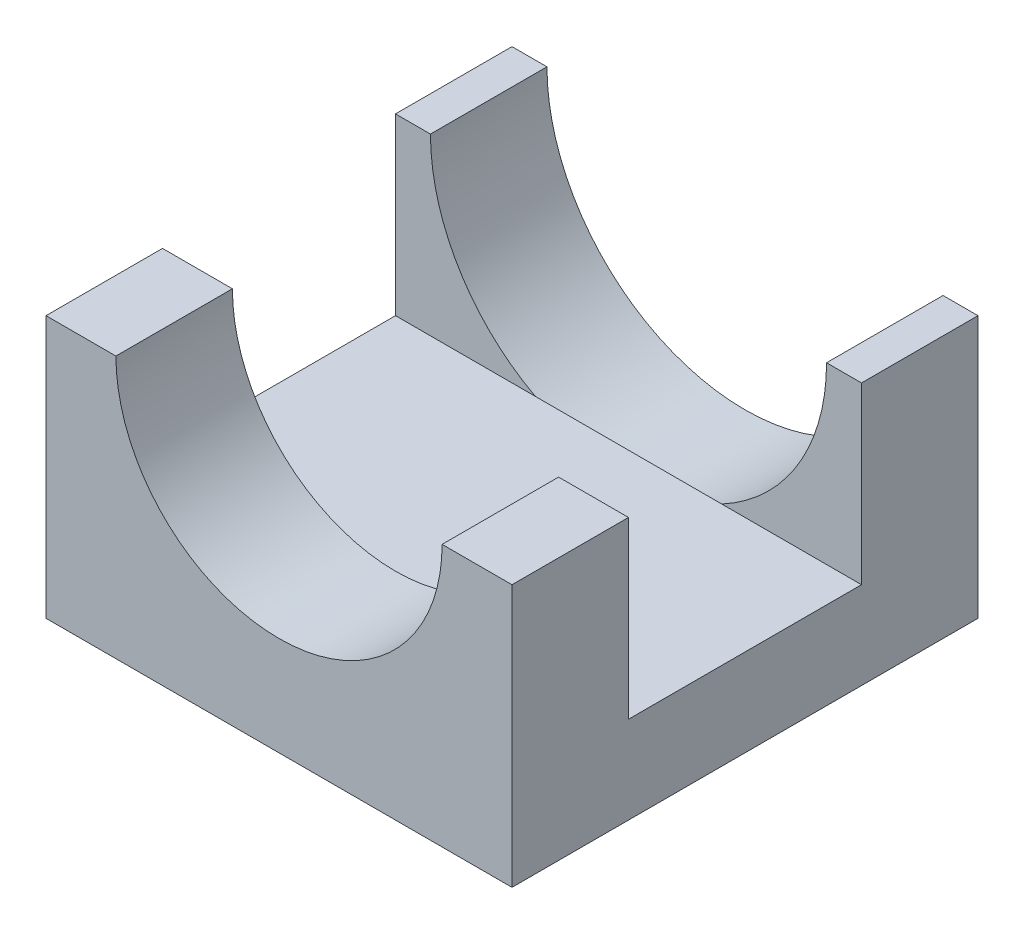
ISO-10303-21;
HEADER;
FILE_DESCRIPTION(('STEP AP214'),'2;1');
FILE_NAME('part.step','',(''),(''),'','','');
FILE_SCHEMA(('AUTOMOTIVE_DESIGN { 1 0 10303 214 1 1 1 1 }'));
ENDSEC;
DATA;
#1=APPLICATION_CONTEXT('core data for automotive mechanical design processes');
#2=APPLICATION_PROTOCOL_DEFINITION('international standard','automotive_design',2000,#1);
#3=PRODUCT_CONTEXT('',#1,'mechanical');
#4=PRODUCT('Part','Part','',(#3));
#5=PRODUCT_RELATED_PRODUCT_CATEGORY('part','',(#4));
#6=PRODUCT_DEFINITION_FORMATION('','',#4);
#7=PRODUCT_DEFINITION_CONTEXT('part definition',#1,'design');
#8=PRODUCT_DEFINITION('design','',#6,#7);
#9=PRODUCT_DEFINITION_SHAPE('','',#8);
#10=(LENGTH_UNIT() NAMED_UNIT(*) SI_UNIT(.MILLI.,.METRE.));
#11=(NAMED_UNIT(*) PLANE_ANGLE_UNIT() SI_UNIT($,.RADIAN.));
#12=(NAMED_UNIT(*) SI_UNIT($,.STERADIAN.) SOLID_ANGLE_UNIT());
#13=UNCERTAINTY_MEASURE_WITH_UNIT(LENGTH_MEASURE(1.E-05),#10,'distance_accuracy_value','');
#14=(GEOMETRIC_REPRESENTATION_CONTEXT(3) GLOBAL_UNCERTAINTY_ASSIGNED_CONTEXT((#13)) GLOBAL_UNIT_ASSIGNED_CONTEXT((#10,
#11,#12)) REPRESENTATION_CONTEXT('',''));
#15=CARTESIAN_POINT('',(0.,0.,0.));
#16=DIRECTION('',(0.,0.,1.));
#17=DIRECTION('',(1.,0.,0.));
#18=AXIS2_PLACEMENT_3D('',#15,#16,#17);
#19=CARTESIAN_POINT('',(0.,0.,10.));
#20=DIRECTION('',(0.,0.,-1.));
#21=DIRECTION('',(-1.,0.,0.));
#22=AXIS2_PLACEMENT_3D('',#19,#20,#21);
#23=PLANE('',#22);
#24=CARTESIAN_POINT('',(0.,0.,10.));
#25=DIRECTION('',(0.,0.,-1.));
#26=DIRECTION('',(-1.,0.,0.));
#27=AXIS2_PLACEMENT_3D('',#24,#25,#26);
#28=CIRCLE('',#27,17.);
#29=CARTESIAN_POINT('',(8.,-15.,10.));
#30=VERTEX_POINT('',#29);
#31=CARTESIAN_POINT('',(-8.00000000000001,-15.,10.));
#32=VERTEX_POINT('',#31);
#33=EDGE_CURVE('E119',#30,#32,#28,.T.);
#34=ORIENTED_EDGE('',*,*,#33,.T.);
#35=DIRECTION('',(-1.,0.,0.));
#36=VECTOR('',#35,1.);
#37=CARTESIAN_POINT('',(-20.,-15.,10.));
#38=LINE('',#37,#36);
#39=EDGE_CURVE('E249',#30,#32,#38,.T.);
#40=ORIENTED_EDGE('',*,*,#39,.F.);
#41=EDGE_LOOP('',(#34,#40));
#42=FACE_BOUND('',#41,.T.);
#43=ADVANCED_FACE('F47',(#42),#23,.T.);
#44=CARTESIAN_POINT('',(-20.,0.,0.));
#45=DIRECTION('',(0.,-1.,0.));
#46=DIRECTION('',(1.,0.,0.));
#47=AXIS2_PLACEMENT_3D('',#44,#45,#46);
#48=PLANE('',#47);
#49=DIRECTION('',(0.,0.,1.));
#50=VECTOR('',#49,1.);
#51=CARTESIAN_POINT('',(-20.,0.,0.));
#52=LINE('',#51,#50);
#53=CARTESIAN_POINT('',(-20.,0.,0.));
#54=VERTEX_POINT('',#53);
#55=CARTESIAN_POINT('',(-20.,0.,10.));
#56=VERTEX_POINT('',#55);
#57=EDGE_CURVE('E196',#54,#56,#52,.T.);
#58=ORIENTED_EDGE('',*,*,#57,.T.);
#59=DIRECTION('',(1.,0.,0.));
#60=VECTOR('',#59,1.);
#61=CARTESIAN_POINT('',(-20.,0.,10.));
#62=LINE('',#61,#60);
#63=CARTESIAN_POINT('',(-17.,0.,10.));
#64=VERTEX_POINT('',#63);
#65=EDGE_CURVE('E11',#56,#64,#62,.T.);
#66=ORIENTED_EDGE('',*,*,#65,.T.);
#67=DIRECTION('',(0.,0.,-1.));
#68=VECTOR('',#67,1.);
#69=CARTESIAN_POINT('',(-17.,0.,10.));
#70=LINE('',#69,#68);
#71=CARTESIAN_POINT('',(-17.,0.,0.));
#72=VERTEX_POINT('',#71);
#73=EDGE_CURVE('E161',#72,#64,#70,.F.);
#74=ORIENTED_EDGE('',*,*,#73,.F.);
#75=DIRECTION('',(1.,0.,0.));
#76=VECTOR('',#75,1.);
#77=CARTESIAN_POINT('',(-20.,0.,0.));
#78=LINE('',#77,#76);
#79=EDGE_CURVE('E200',#54,#72,#78,.T.);
#80=ORIENTED_EDGE('',*,*,#79,.F.);
#81=EDGE_LOOP('',(#58,#66,#74,#80));
#82=FACE_BOUND('',#81,.T.);
#83=ADVANCED_FACE('F315',(#82),#48,.F.);
#84=DIRECTION('',(0.,0.,-1.));
#85=VECTOR('',#84,1.);
#86=CARTESIAN_POINT('',(17.,0.,10.));
#87=LINE('',#86,#85);
#88=CARTESIAN_POINT('',(17.,0.,10.));
#89=VERTEX_POINT('',#88);
#90=CARTESIAN_POINT('',(17.,0.,0.));
#91=VERTEX_POINT('',#90);
#92=EDGE_CURVE('E155',#89,#91,#87,.T.);
#93=ORIENTED_EDGE('',*,*,#92,.F.);
#94=DIRECTION('',(-1.,0.,0.));
#95=VECTOR('',#94,1.);
#96=CARTESIAN_POINT('',(-20.,0.,10.));
#97=LINE('',#96,#95);
#98=CARTESIAN_POINT('',(20.,0.,10.));
#99=VERTEX_POINT('',#98);
#100=EDGE_CURVE('E241',#99,#89,#97,.T.);
#101=ORIENTED_EDGE('',*,*,#100,.F.);
#102=DIRECTION('',(0.,0.,1.));
#103=VECTOR('',#102,1.);
#104=CARTESIAN_POINT('',(20.,0.,0.));
#105=LINE('',#104,#103);
#106=CARTESIAN_POINT('',(20.,0.,0.));
#107=VERTEX_POINT('',#106);
#108=EDGE_CURVE('E163',#107,#99,#105,.T.);
#109=ORIENTED_EDGE('',*,*,#108,.F.);
#110=EDGE_CURVE('E111',#91,#107,#78,.T.);
#111=ORIENTED_EDGE('',*,*,#110,.F.);
#112=EDGE_LOOP('',(#93,#101,#109,#111));
#113=FACE_BOUND('',#112,.T.);
#114=ADVANCED_FACE('F219',(#113),#48,.F.);
#115=CARTESIAN_POINT('',(20.,0.,30.));
#116=VERTEX_POINT('',#115);
#117=CARTESIAN_POINT('',(20.,0.,40.));
#118=VERTEX_POINT('',#117);
#119=EDGE_CURVE('E139',#116,#118,#105,.T.);
#120=ORIENTED_EDGE('',*,*,#119,.F.);
#121=DIRECTION('',(-1.,0.,0.));
#122=VECTOR('',#121,1.);
#123=CARTESIAN_POINT('',(-20.,0.,30.));
#124=LINE('',#123,#122);
#125=CARTESIAN_POINT('',(14.,0.,30.));
#126=VERTEX_POINT('',#125);
#127=EDGE_CURVE('E56',#116,#126,#124,.T.);
#128=ORIENTED_EDGE('',*,*,#127,.T.);
#129=DIRECTION('',(0.,0.,1.));
#130=VECTOR('',#129,1.);
#131=CARTESIAN_POINT('',(14.,0.,30.));
#132=LINE('',#131,#130);
#133=CARTESIAN_POINT('',(14.,0.,40.));
#134=VERTEX_POINT('',#133);
#135=EDGE_CURVE('E136',#134,#126,#132,.F.);
#136=ORIENTED_EDGE('',*,*,#135,.F.);
#137=DIRECTION('',(1.,0.,0.));
#138=VECTOR('',#137,1.);
#139=CARTESIAN_POINT('',(-20.,0.,40.));
#140=LINE('',#139,#138);
#141=EDGE_CURVE('E281',#134,#118,#140,.T.);
#142=ORIENTED_EDGE('',*,*,#141,.T.);
#143=EDGE_LOOP('',(#120,#128,#136,#142));
#144=FACE_BOUND('',#143,.T.);
#145=ADVANCED_FACE('F133',(#144),#48,.F.);
#146=CARTESIAN_POINT('',(20.,22.5,40.));
#147=DIRECTION('',(-1.,0.,0.));
#148=DIRECTION('',(0.,-1.,0.));
#149=AXIS2_PLACEMENT_3D('',#146,#147,#148);
#150=PLANE('',#149);
#151=ORIENTED_EDGE('',*,*,#108,.T.);
#152=DIRECTION('',(0.,1.,0.));
#153=VECTOR('',#152,1.);
#154=CARTESIAN_POINT('',(20.,-15.,10.));
#155=LINE('',#154,#153);
#156=CARTESIAN_POINT('',(20.,-15.,10.));
#157=VERTEX_POINT('',#156);
#158=EDGE_CURVE('E272',#157,#99,#155,.T.);
#159=ORIENTED_EDGE('',*,*,#158,.F.);
#160=DIRECTION('',(0.,0.,-1.));
#161=VECTOR('',#160,1.);
#162=CARTESIAN_POINT('',(20.,-15.,10.));
#163=LINE('',#162,#161);
#164=CARTESIAN_POINT('',(20.,-15.,30.));
#165=VERTEX_POINT('',#164);
#166=EDGE_CURVE('E252',#165,#157,#163,.T.);
#167=ORIENTED_EDGE('',*,*,#166,.F.);
#168=DIRECTION('',(0.,1.,0.));
#169=VECTOR('',#168,1.);
#170=CARTESIAN_POINT('',(20.,-15.,30.));
#171=LINE('',#170,#169);
#172=EDGE_CURVE('E275',#165,#116,#171,.T.);
#173=ORIENTED_EDGE('',*,*,#172,.T.);
#174=ORIENTED_EDGE('',*,*,#119,.T.);
#175=DIRECTION('',(0.,1.,0.));
#176=VECTOR('',#175,1.);
#177=CARTESIAN_POINT('',(20.,22.5,40.));
#178=LINE('',#177,#176);
#179=CARTESIAN_POINT('',(20.,-22.5,40.));
#180=VERTEX_POINT('',#179);
#181=EDGE_CURVE('E96',#180,#118,#178,.T.);
#182=ORIENTED_EDGE('',*,*,#181,.F.);
#183=DIRECTION('',(0.,0.,-1.));
#184=VECTOR('',#183,1.);
#185=CARTESIAN_POINT('',(20.,-22.5,40.));
#186=LINE('',#185,#184);
#187=CARTESIAN_POINT('',(20.,-22.5,0.));
#188=VERTEX_POINT('',#187);
#189=EDGE_CURVE('E88',#180,#188,#186,.T.);
#190=ORIENTED_EDGE('',*,*,#189,.T.);
#191=DIRECTION('',(0.,1.,0.));
#192=VECTOR('',#191,1.);
#193=CARTESIAN_POINT('',(20.,22.5,0.));
#194=LINE('',#193,#192);
#195=EDGE_CURVE('E103',#188,#107,#194,.T.);
#196=ORIENTED_EDGE('',*,*,#195,.T.);
#197=EDGE_LOOP('',(#151,#159,#167,#173,#174,#182,#190,#196));
#198=FACE_BOUND('',#197,.T.);
#199=ADVANCED_FACE('F49',(#198),#150,.F.);
#200=CARTESIAN_POINT('',(-20.,22.5,40.));
#201=DIRECTION('',(1.,0.,0.));
#202=DIRECTION('',(0.,1.,0.));
#203=AXIS2_PLACEMENT_3D('',#200,#201,#202);
#204=PLANE('',#203);
#205=DIRECTION('',(0.,0.,1.));
#206=VECTOR('',#205,1.);
#207=CARTESIAN_POINT('',(-20.,-15.,10.));
#208=LINE('',#207,#206);
#209=CARTESIAN_POINT('',(-20.,-15.,10.));
#210=VERTEX_POINT('',#209);
#211=CARTESIAN_POINT('',(-20.,-15.,30.));
#212=VERTEX_POINT('',#211);
#213=EDGE_CURVE('E267',#210,#212,#208,.T.);
#214=ORIENTED_EDGE('',*,*,#213,.F.);
#215=DIRECTION('',(0.,1.,0.));
#216=VECTOR('',#215,1.);
#217=CARTESIAN_POINT('',(-20.,-15.,10.));
#218=LINE('',#217,#216);
#219=EDGE_CURVE('E268',#210,#56,#218,.T.);
#220=ORIENTED_EDGE('',*,*,#219,.T.);
#221=ORIENTED_EDGE('',*,*,#57,.F.);
#222=DIRECTION('',(0.,-1.,0.));
#223=VECTOR('',#222,1.);
#224=CARTESIAN_POINT('',(-20.,22.5,0.));
#225=LINE('',#224,#223);
#226=CARTESIAN_POINT('',(-20.,-22.5,0.));
#227=VERTEX_POINT('',#226);
#228=EDGE_CURVE('E97',#54,#227,#225,.T.);
#229=ORIENTED_EDGE('',*,*,#228,.T.);
#230=DIRECTION('',(0.,0.,-1.));
#231=VECTOR('',#230,1.);
#232=CARTESIAN_POINT('',(-20.,-22.5,40.));
#233=LINE('',#232,#231);
#234=CARTESIAN_POINT('',(-20.,-22.5,40.));
#235=VERTEX_POINT('',#234);
#236=EDGE_CURVE('E91',#235,#227,#233,.T.);
#237=ORIENTED_EDGE('',*,*,#236,.F.);
#238=DIRECTION('',(0.,-1.,0.));
#239=VECTOR('',#238,1.);
#240=CARTESIAN_POINT('',(-20.,22.5,40.));
#241=LINE('',#240,#239);
#242=CARTESIAN_POINT('',(-20.,0.,40.));
#243=VERTEX_POINT('',#242);
#244=EDGE_CURVE('E179',#243,#235,#241,.T.);
#245=ORIENTED_EDGE('',*,*,#244,.F.);
#246=CARTESIAN_POINT('',(-20.,0.,30.));
#247=VERTEX_POINT('',#246);
#248=EDGE_CURVE('E284',#247,#243,#52,.T.);
#249=ORIENTED_EDGE('',*,*,#248,.F.);
#250=DIRECTION('',(0.,1.,0.));
#251=VECTOR('',#250,1.);
#252=CARTESIAN_POINT('',(-20.,-15.,30.));
#253=LINE('',#252,#251);
#254=EDGE_CURVE('E63',#212,#247,#253,.T.);
#255=ORIENTED_EDGE('',*,*,#254,.F.);
#256=EDGE_LOOP('',(#214,#220,#221,#229,#237,#245,#249,#255));
#257=FACE_BOUND('',#256,.T.);
#258=ADVANCED_FACE('F191',(#257),#204,.F.);
#259=CARTESIAN_POINT('',(-20.,-22.5,40.));
#260=DIRECTION('',(0.,1.,0.));
#261=DIRECTION('',(0.,0.,1.));
#262=AXIS2_PLACEMENT_3D('',#259,#260,#261);
#263=PLANE('',#262);
#264=DIRECTION('',(1.,0.,0.));
#265=VECTOR('',#264,1.);
#266=CARTESIAN_POINT('',(-20.,-22.5,0.));
#267=LINE('',#266,#265);
#268=EDGE_CURVE('E85',#227,#188,#267,.T.);
#269=ORIENTED_EDGE('',*,*,#268,.T.);
#270=ORIENTED_EDGE('',*,*,#189,.F.);
#271=DIRECTION('',(1.,0.,0.));
#272=VECTOR('',#271,1.);
#273=CARTESIAN_POINT('',(-20.,-22.5,40.));
#274=LINE('',#273,#272);
#275=EDGE_CURVE('E72',#235,#180,#274,.T.);
#276=ORIENTED_EDGE('',*,*,#275,.F.);
#277=ORIENTED_EDGE('',*,*,#236,.T.);
#278=EDGE_LOOP('',(#269,#270,#276,#277));
#279=FACE_BOUND('',#278,.T.);
#280=ADVANCED_FACE('F87',(#279),#263,.F.);
#281=CARTESIAN_POINT('',(0.,0.,40.));
#282=DIRECTION('',(0.,0.,1.));
#283=DIRECTION('',(1.,0.,0.));
#284=AXIS2_PLACEMENT_3D('',#281,#282,#283);
#285=PLANE('',#284);
#286=CARTESIAN_POINT('',(-14.,0.,40.));
#287=VERTEX_POINT('',#286);
#288=EDGE_CURVE('E187',#243,#287,#140,.T.);
#289=ORIENTED_EDGE('',*,*,#288,.F.);
#290=ORIENTED_EDGE('',*,*,#244,.T.);
#291=ORIENTED_EDGE('',*,*,#275,.T.);
#292=ORIENTED_EDGE('',*,*,#181,.T.);
#293=ORIENTED_EDGE('',*,*,#141,.F.);
#294=CARTESIAN_POINT('',(0.,0.,40.));
#295=DIRECTION('',(0.,0.,1.));
#296=DIRECTION('',(1.,0.,0.));
#297=AXIS2_PLACEMENT_3D('',#294,#295,#296);
#298=CIRCLE('',#297,14.);
#299=EDGE_CURVE('E153',#287,#134,#298,.T.);
#300=ORIENTED_EDGE('',*,*,#299,.F.);
#301=EDGE_LOOP('',(#289,#290,#291,#292,#293,#300));
#302=FACE_BOUND('',#301,.T.);
#303=ADVANCED_FACE('F184',(#302),#285,.T.);
#304=CARTESIAN_POINT('',(0.,0.,0.));
#305=DIRECTION('',(0.,0.,1.));
#306=DIRECTION('',(1.,0.,0.));
#307=AXIS2_PLACEMENT_3D('',#304,#305,#306);
#308=PLANE('',#307);
#309=ORIENTED_EDGE('',*,*,#228,.F.);
#310=ORIENTED_EDGE('',*,*,#79,.T.);
#311=CARTESIAN_POINT('',(0.,0.,0.));
#312=DIRECTION('',(0.,0.,-1.));
#313=DIRECTION('',(-1.,0.,0.));
#314=AXIS2_PLACEMENT_3D('',#311,#312,#313);
#315=CIRCLE('',#314,17.);
#316=EDGE_CURVE('E172',#91,#72,#315,.T.);
#317=ORIENTED_EDGE('',*,*,#316,.F.);
#318=ORIENTED_EDGE('',*,*,#110,.T.);
#319=ORIENTED_EDGE('',*,*,#195,.F.);
#320=ORIENTED_EDGE('',*,*,#268,.F.);
#321=EDGE_LOOP('',(#309,#310,#317,#318,#319,#320));
#322=FACE_BOUND('',#321,.T.);
#323=ADVANCED_FACE('F108',(#322),#308,.F.);
#324=CARTESIAN_POINT('',(0.,0.,10.));
#325=DIRECTION('',(0.,0.,-1.));
#326=DIRECTION('',(-1.,0.,0.));
#327=AXIS2_PLACEMENT_3D('',#324,#325,#326);
#328=CYLINDRICAL_SURFACE('',#327,17.);
#329=ORIENTED_EDGE('',*,*,#316,.T.);
#330=ORIENTED_EDGE('',*,*,#73,.T.);
#331=CARTESIAN_POINT('',(0.,0.,10.));
#332=DIRECTION('',(0.,0.,-1.));
#333=DIRECTION('',(-1.,0.,0.));
#334=AXIS2_PLACEMENT_3D('',#331,#332,#333);
#335=CIRCLE('',#334,17.);
#336=EDGE_CURVE('E271',#64,#32,#335,.F.);
#337=ORIENTED_EDGE('',*,*,#336,.T.);
#338=ORIENTED_EDGE('',*,*,#33,.F.);
#339=EDGE_CURVE('E113',#89,#30,#28,.T.);
#340=ORIENTED_EDGE('',*,*,#339,.F.);
#341=ORIENTED_EDGE('',*,*,#92,.T.);
#342=EDGE_LOOP('',(#329,#330,#337,#338,#340,#341));
#343=FACE_BOUND('',#342,.T.);
#344=ADVANCED_FACE('F225',(#343),#328,.F.);
#345=CARTESIAN_POINT('',(0.,0.,30.));
#346=DIRECTION('',(0.,0.,1.));
#347=DIRECTION('',(1.,0.,0.));
#348=AXIS2_PLACEMENT_3D('',#345,#346,#347);
#349=CYLINDRICAL_SURFACE('',#348,14.);
#350=ORIENTED_EDGE('',*,*,#299,.T.);
#351=ORIENTED_EDGE('',*,*,#135,.T.);
#352=CARTESIAN_POINT('',(0.,0.,30.));
#353=DIRECTION('',(0.,0.,1.));
#354=DIRECTION('',(1.,0.,0.));
#355=AXIS2_PLACEMENT_3D('',#352,#353,#354);
#356=CIRCLE('',#355,14.);
#357=CARTESIAN_POINT('',(-14.,0.,30.));
#358=VERTEX_POINT('',#357);
#359=EDGE_CURVE('E151',#358,#126,#356,.T.);
#360=ORIENTED_EDGE('',*,*,#359,.F.);
#361=DIRECTION('',(0.,0.,1.));
#362=VECTOR('',#361,1.);
#363=CARTESIAN_POINT('',(-14.,0.,30.));
#364=LINE('',#363,#362);
#365=EDGE_CURVE('E156',#358,#287,#364,.T.);
#366=ORIENTED_EDGE('',*,*,#365,.T.);
#367=EDGE_LOOP('',(#350,#351,#360,#366));
#368=FACE_BOUND('',#367,.T.);
#369=ADVANCED_FACE('F149',(#368),#349,.F.);
#370=ORIENTED_EDGE('',*,*,#365,.F.);
#371=DIRECTION('',(1.,0.,0.));
#372=VECTOR('',#371,1.);
#373=CARTESIAN_POINT('',(-20.,0.,30.));
#374=LINE('',#373,#372);
#375=EDGE_CURVE('E262',#247,#358,#374,.T.);
#376=ORIENTED_EDGE('',*,*,#375,.F.);
#377=ORIENTED_EDGE('',*,*,#248,.T.);
#378=ORIENTED_EDGE('',*,*,#288,.T.);
#379=EDGE_LOOP('',(#370,#376,#377,#378));
#380=FACE_BOUND('',#379,.T.);
#381=ADVANCED_FACE('F294',(#380),#48,.F.);
#382=CARTESIAN_POINT('',(-20.,-15.,10.));
#383=DIRECTION('',(0.,0.,-1.));
#384=DIRECTION('',(-1.,0.,0.));
#385=AXIS2_PLACEMENT_3D('',#382,#383,#384);
#386=PLANE('',#385);
#387=ORIENTED_EDGE('',*,*,#65,.F.);
#388=ORIENTED_EDGE('',*,*,#219,.F.);
#389=EDGE_CURVE('E255',#32,#210,#38,.T.);
#390=ORIENTED_EDGE('',*,*,#389,.F.);
#391=ORIENTED_EDGE('',*,*,#336,.F.);
#392=EDGE_LOOP('',(#387,#388,#390,#391));
#393=FACE_BOUND('',#392,.T.);
#394=ADVANCED_FACE('F313',(#393),#386,.F.);
#395=EDGE_CURVE('E239',#157,#30,#38,.T.);
#396=ORIENTED_EDGE('',*,*,#395,.F.);
#397=ORIENTED_EDGE('',*,*,#158,.T.);
#398=ORIENTED_EDGE('',*,*,#100,.T.);
#399=ORIENTED_EDGE('',*,*,#339,.T.);
#400=EDGE_LOOP('',(#396,#397,#398,#399));
#401=FACE_BOUND('',#400,.T.);
#402=ADVANCED_FACE('F236',(#401),#386,.F.);
#403=CARTESIAN_POINT('',(-20.,-15.,30.));
#404=DIRECTION('',(0.,0.,1.));
#405=DIRECTION('',(1.,0.,0.));
#406=AXIS2_PLACEMENT_3D('',#403,#404,#405);
#407=PLANE('',#406);
#408=ORIENTED_EDGE('',*,*,#127,.F.);
#409=ORIENTED_EDGE('',*,*,#172,.F.);
#410=DIRECTION('',(1.,0.,0.));
#411=VECTOR('',#410,1.);
#412=CARTESIAN_POINT('',(-20.,-15.,30.));
#413=LINE('',#412,#411);
#414=EDGE_CURVE('E299',#212,#165,#413,.T.);
#415=ORIENTED_EDGE('',*,*,#414,.F.);
#416=ORIENTED_EDGE('',*,*,#254,.T.);
#417=ORIENTED_EDGE('',*,*,#375,.T.);
#418=ORIENTED_EDGE('',*,*,#359,.T.);
#419=EDGE_LOOP('',(#408,#409,#415,#416,#417,#418));
#420=FACE_BOUND('',#419,.T.);
#421=ADVANCED_FACE('F395',(#420),#407,.F.);
#422=CARTESIAN_POINT('',(0.,-15.,0.));
#423=DIRECTION('',(0.,1.,0.));
#424=DIRECTION('',(-1.,0.,0.));
#425=AXIS2_PLACEMENT_3D('',#422,#423,#424);
#426=PLANE('',#425);
#427=ORIENTED_EDGE('',*,*,#213,.T.);
#428=ORIENTED_EDGE('',*,*,#414,.T.);
#429=ORIENTED_EDGE('',*,*,#166,.T.);
#430=ORIENTED_EDGE('',*,*,#395,.T.);
#431=ORIENTED_EDGE('',*,*,#39,.T.);
#432=ORIENTED_EDGE('',*,*,#389,.T.);
#433=EDGE_LOOP('',(#427,#428,#429,#430,#431,#432));
#434=FACE_BOUND('',#433,.T.);
#435=ADVANCED_FACE('F247',(#434),#426,.T.);
#436=CLOSED_SHELL('',(#43,#83,#114,#145,#199,#258,#280,#303,#323,#344,#369,#381,#394,#402,#421,#435));
#437=MANIFOLD_SOLID_BREP('B2',#436);
#438=ADVANCED_BREP_SHAPE_REPRESENTATION('',(#18,#437),#14);
#439=SHAPE_DEFINITION_REPRESENTATION(#9,#438);
ENDSEC;
END-ISO-10303-21;
